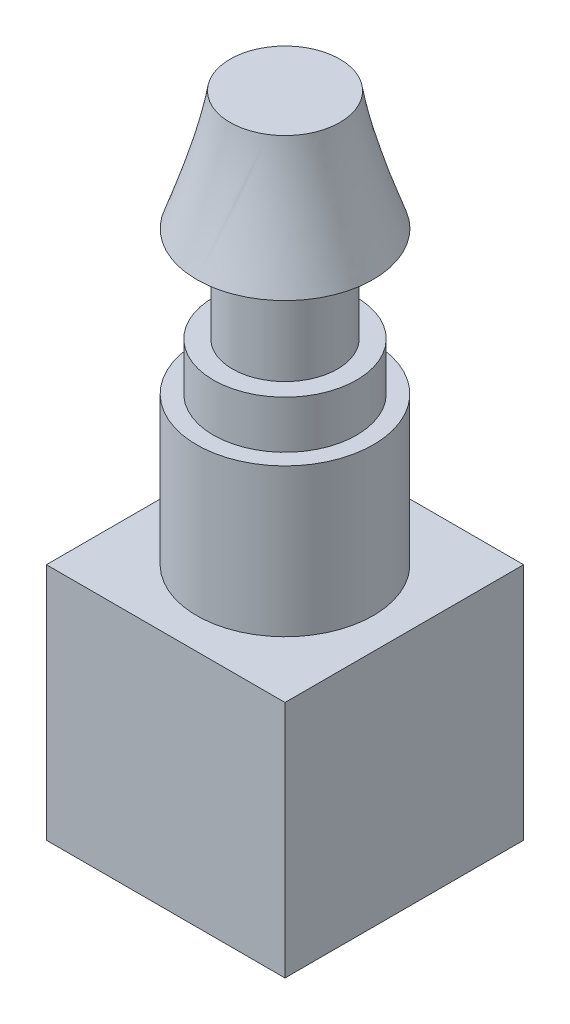
ISO-10303-21;
HEADER;
FILE_DESCRIPTION(('STEP AP214'),'2;1');
FILE_NAME('part.step','',(''),(''),'','','');
FILE_SCHEMA(('AUTOMOTIVE_DESIGN { 1 0 10303 214 1 1 1 1 }'));
ENDSEC;
DATA;
#1=APPLICATION_CONTEXT('core data for automotive mechanical design processes');
#2=APPLICATION_PROTOCOL_DEFINITION('international standard','automotive_design',2000,#1);
#3=PRODUCT_CONTEXT('',#1,'mechanical');
#4=PRODUCT('Part','Part','',(#3));
#5=PRODUCT_RELATED_PRODUCT_CATEGORY('part','',(#4));
#6=PRODUCT_DEFINITION_FORMATION('','',#4);
#7=PRODUCT_DEFINITION_CONTEXT('part definition',#1,'design');
#8=PRODUCT_DEFINITION('design','',#6,#7);
#9=PRODUCT_DEFINITION_SHAPE('','',#8);
#10=(LENGTH_UNIT() NAMED_UNIT(*) SI_UNIT(.MILLI.,.METRE.));
#11=(NAMED_UNIT(*) PLANE_ANGLE_UNIT() SI_UNIT($,.RADIAN.));
#12=(NAMED_UNIT(*) SI_UNIT($,.STERADIAN.) SOLID_ANGLE_UNIT());
#13=UNCERTAINTY_MEASURE_WITH_UNIT(LENGTH_MEASURE(1.E-05),#10,'distance_accuracy_value','');
#14=(GEOMETRIC_REPRESENTATION_CONTEXT(3) GLOBAL_UNCERTAINTY_ASSIGNED_CONTEXT((#13)) GLOBAL_UNIT_ASSIGNED_CONTEXT((#10,
#11,#12)) REPRESENTATION_CONTEXT('',''));
#15=CARTESIAN_POINT('',(0.,0.,0.));
#16=DIRECTION('',(0.,0.,1.));
#17=DIRECTION('',(1.,0.,0.));
#18=AXIS2_PLACEMENT_3D('',#15,#16,#17);
#19=CARTESIAN_POINT('',(0.,3.1,0.));
#20=DIRECTION('',(0.,-1.,0.));
#21=DIRECTION('',(0.,0.,-1.));
#22=AXIS2_PLACEMENT_3D('',#19,#20,#21);
#23=CYLINDRICAL_SURFACE('',#22,1.85);
#24=CARTESIAN_POINT('',(0.,3.1,0.));
#25=DIRECTION('',(0.,1.,0.));
#26=DIRECTION('',(0.,0.,1.));
#27=AXIS2_PLACEMENT_3D('',#24,#25,#26);
#28=CIRCLE('',#27,1.85);
#29=CARTESIAN_POINT('',(0.,3.1,-1.85));
#30=VERTEX_POINT('',#29);
#31=EDGE_CURVE('E174',#30,#30,#28,.T.);
#32=CARTESIAN_POINT('',(0.,0.,0.));
#33=DIRECTION('',(0.,1.,0.));
#34=DIRECTION('',(0.,0.,1.));
#35=AXIS2_PLACEMENT_3D('',#32,#33,#34);
#36=CIRCLE('',#35,1.85);
#37=CARTESIAN_POINT('',(0.,0.,-1.85));
#38=VERTEX_POINT('',#37);
#39=EDGE_CURVE('E42',#38,#38,#36,.T.);
#40=CARTESIAN_POINT('',(0.,3.1,-1.85));
#41=CARTESIAN_POINT('',(0.,3.06770833333333,-1.85));
#42=CARTESIAN_POINT('',(0.,3.03541666666667,-1.85));
#43=CARTESIAN_POINT('',(0.,2.97083333333333,-1.85));
#44=CARTESIAN_POINT('',(0.,2.93854166666667,-1.85));
#45=CARTESIAN_POINT('',(0.,2.87395833333333,-1.85));
#46=CARTESIAN_POINT('',(0.,2.84166666666667,-1.85));
#47=CARTESIAN_POINT('',(0.,2.77708333333333,-1.85));
#48=CARTESIAN_POINT('',(0.,2.74479166666667,-1.85));
#49=CARTESIAN_POINT('',(0.,2.68020833333333,-1.85));
#50=CARTESIAN_POINT('',(0.,2.64791666666667,-1.85));
#51=CARTESIAN_POINT('',(0.,2.58333333333333,-1.85));
#52=CARTESIAN_POINT('',(0.,2.55104166666667,-1.85));
#53=CARTESIAN_POINT('',(0.,2.48645833333333,-1.85));
#54=CARTESIAN_POINT('',(0.,2.45416666666667,-1.85));
#55=CARTESIAN_POINT('',(0.,2.38958333333333,-1.85));
#56=CARTESIAN_POINT('',(0.,2.35729166666667,-1.85));
#57=CARTESIAN_POINT('',(0.,2.29270833333333,-1.85));
#58=CARTESIAN_POINT('',(0.,2.26041666666667,-1.85));
#59=CARTESIAN_POINT('',(0.,2.19583333333333,-1.85));
#60=CARTESIAN_POINT('',(0.,2.16354166666667,-1.85));
#61=CARTESIAN_POINT('',(0.,2.09895833333333,-1.85));
#62=CARTESIAN_POINT('',(0.,2.06666666666667,-1.85));
#63=CARTESIAN_POINT('',(0.,2.00208333333333,-1.85));
#64=CARTESIAN_POINT('',(0.,1.96979166666667,-1.85));
#65=CARTESIAN_POINT('',(0.,1.90520833333333,-1.85));
#66=CARTESIAN_POINT('',(0.,1.87291666666667,-1.85));
#67=CARTESIAN_POINT('',(0.,1.80833333333333,-1.85));
#68=CARTESIAN_POINT('',(0.,1.77604166666667,-1.85));
#69=CARTESIAN_POINT('',(0.,1.71145833333333,-1.85));
#70=CARTESIAN_POINT('',(0.,1.67916666666667,-1.85));
#71=CARTESIAN_POINT('',(0.,1.61458333333333,-1.85));
#72=CARTESIAN_POINT('',(0.,1.58229166666667,-1.85));
#73=CARTESIAN_POINT('',(0.,1.51770833333333,-1.85));
#74=CARTESIAN_POINT('',(0.,1.48541666666667,-1.85));
#75=CARTESIAN_POINT('',(0.,1.42083333333333,-1.85));
#76=CARTESIAN_POINT('',(0.,1.38854166666667,-1.85));
#77=CARTESIAN_POINT('',(0.,1.32395833333333,-1.85));
#78=CARTESIAN_POINT('',(0.,1.29166666666667,-1.85));
#79=CARTESIAN_POINT('',(0.,1.22708333333333,-1.85));
#80=CARTESIAN_POINT('',(0.,1.19479166666667,-1.85));
#81=CARTESIAN_POINT('',(0.,1.13020833333333,-1.85));
#82=CARTESIAN_POINT('',(0.,1.09791666666667,-1.85));
#83=CARTESIAN_POINT('',(0.,1.03333333333333,-1.85));
#84=CARTESIAN_POINT('',(0.,1.00104166666667,-1.85));
#85=CARTESIAN_POINT('',(0.,0.936458333333333,-1.85));
#86=CARTESIAN_POINT('',(0.,0.904166666666667,-1.85));
#87=CARTESIAN_POINT('',(0.,0.839583333333333,-1.85));
#88=CARTESIAN_POINT('',(0.,0.807291666666667,-1.85));
#89=CARTESIAN_POINT('',(0.,0.742708333333333,-1.85));
#90=CARTESIAN_POINT('',(0.,0.710416666666667,-1.85));
#91=CARTESIAN_POINT('',(0.,0.645833333333333,-1.85));
#92=CARTESIAN_POINT('',(0.,0.613541666666667,-1.85));
#93=CARTESIAN_POINT('',(0.,0.548958333333333,-1.85));
#94=CARTESIAN_POINT('',(0.,0.516666666666667,-1.85));
#95=CARTESIAN_POINT('',(0.,0.452083333333333,-1.85));
#96=CARTESIAN_POINT('',(0.,0.419791666666667,-1.85));
#97=CARTESIAN_POINT('',(0.,0.355208333333333,-1.85));
#98=CARTESIAN_POINT('',(0.,0.322916666666667,-1.85));
#99=CARTESIAN_POINT('',(0.,0.258333333333333,-1.85));
#100=CARTESIAN_POINT('',(0.,0.226041666666667,-1.85));
#101=CARTESIAN_POINT('',(0.,0.161458333333333,-1.85));
#102=CARTESIAN_POINT('',(0.,0.129166666666667,-1.85));
#103=CARTESIAN_POINT('',(0.,0.0645833333333335,-1.85));
#104=CARTESIAN_POINT('',(0.,0.0322916666666667,-1.85));
#105=CARTESIAN_POINT('',(0.,0.,-1.85));
#106=B_SPLINE_CURVE_WITH_KNOTS('',3,(#40,#41,#42,#43,#44,#45,#46,#47,#48,#49,#50,#51,#52,#53,
#54,#55,#56,#57,#58,#59,#60,#61,#62,#63,#64,#65,#66,#67,#68,#69,#70,#71,#72,#73,#74,#75,#76,#77,
#78,#79,#80,#81,#82,#83,#84,#85,#86,#87,#88,#89,#90,#91,#92,#93,#94,#95,#96,#97,#98,#99,#100,
#101,#102,#103,#104,#105),.UNSPECIFIED.,.F.,.F.,(4,2,2,2,2,2,2,2,2,2,2,2,2,2,2,2,2,2,2,2,2,2,2,
2,2,2,2,2,2,2,2,2,4),(0.,0.0968749999999997,0.19375,0.290625,0.3875,0.484375,0.58125,0.678125,
0.775,0.871874999999999,0.96875,1.065625,1.1625,1.259375,1.35625,1.453125,1.55,1.646875,1.74375,
1.840625,1.9375,2.034375,2.13125,2.228125,2.325,2.421875,2.51875,2.615625,2.7125,2.809375,
2.90625,3.003125,3.1),.UNSPECIFIED.);
#107=EDGE_CURVE('BSEAM39',#30,#38,#106,.T.);
#108=ORIENTED_EDGE('',*,*,#31,.F.);
#109=ORIENTED_EDGE('',*,*,#39,.T.);
#110=ORIENTED_EDGE('',*,*,#107,.T.);
#111=ORIENTED_EDGE('',*,*,#107,.F.);
#112=EDGE_LOOP('',(#108,#110,#109,#111));
#113=FACE_BOUND('',#112,.T.);
#114=ADVANCED_FACE('F39',(#113),#23,.T.);
#115=CARTESIAN_POINT('',(0.,3.1,0.));
#116=DIRECTION('',(0.,1.,0.));
#117=DIRECTION('',(0.,0.,1.));
#118=AXIS2_PLACEMENT_3D('',#115,#116,#117);
#119=PLANE('',#118);
#120=CARTESIAN_POINT('',(0.,3.1,0.));
#121=DIRECTION('',(0.,1.,0.));
#122=DIRECTION('',(0.,0.,1.));
#123=AXIS2_PLACEMENT_3D('',#120,#121,#122);
#124=CIRCLE('',#123,1.5);
#125=CARTESIAN_POINT('',(0.,3.1,1.5));
#126=VERTEX_POINT('',#125);
#127=EDGE_CURVE('E48',#126,#126,#124,.T.);
#128=ORIENTED_EDGE('',*,*,#127,.F.);
#129=EDGE_LOOP('',(#128));
#130=FACE_BOUND('',#129,.T.);
#131=ORIENTED_EDGE('',*,*,#31,.T.);
#132=EDGE_LOOP('',(#131));
#133=FACE_BOUND('',#132,.T.);
#134=ADVANCED_FACE('F179',(#130,#133),#119,.T.);
#135=CARTESIAN_POINT('',(0.,4.1,0.));
#136=DIRECTION('',(0.,-1.,0.));
#137=DIRECTION('',(0.,0.,-1.));
#138=AXIS2_PLACEMENT_3D('',#135,#136,#137);
#139=CYLINDRICAL_SURFACE('',#138,1.5);
#140=CARTESIAN_POINT('',(0.,4.1,0.));
#141=DIRECTION('',(0.,1.,0.));
#142=DIRECTION('',(0.,0.,1.));
#143=AXIS2_PLACEMENT_3D('',#140,#141,#142);
#144=CIRCLE('',#143,1.5);
#145=CARTESIAN_POINT('',(0.,4.1,1.5));
#146=VERTEX_POINT('',#145);
#147=EDGE_CURVE('E170',#146,#146,#144,.T.);
#148=ORIENTED_EDGE('',*,*,#147,.F.);
#149=EDGE_LOOP('',(#148));
#150=FACE_BOUND('',#149,.T.);
#151=ORIENTED_EDGE('',*,*,#127,.T.);
#152=EDGE_LOOP('',(#151));
#153=FACE_BOUND('',#152,.T.);
#154=ADVANCED_FACE('F202',(#150,#153),#139,.T.);
#155=CARTESIAN_POINT('',(0.,4.1,0.));
#156=DIRECTION('',(0.,1.,0.));
#157=DIRECTION('',(0.,0.,1.));
#158=AXIS2_PLACEMENT_3D('',#155,#156,#157);
#159=PLANE('',#158);
#160=CARTESIAN_POINT('',(0.,4.1,0.));
#161=DIRECTION('',(0.,1.,0.));
#162=DIRECTION('',(0.,0.,1.));
#163=AXIS2_PLACEMENT_3D('',#160,#161,#162);
#164=CIRCLE('',#163,1.1);
#165=CARTESIAN_POINT('',(0.,4.1,1.1));
#166=VERTEX_POINT('',#165);
#167=EDGE_CURVE('E12',#166,#166,#164,.T.);
#168=ORIENTED_EDGE('',*,*,#167,.F.);
#169=EDGE_LOOP('',(#168));
#170=FACE_BOUND('',#169,.T.);
#171=ORIENTED_EDGE('',*,*,#147,.T.);
#172=EDGE_LOOP('',(#171));
#173=FACE_BOUND('',#172,.T.);
#174=ADVANCED_FACE('F197',(#170,#173),#159,.T.);
#175=CARTESIAN_POINT('',(0.,6.1,0.));
#176=DIRECTION('',(0.,-1.,0.));
#177=DIRECTION('',(0.,0.,-1.));
#178=AXIS2_PLACEMENT_3D('',#175,#176,#177);
#179=CYLINDRICAL_SURFACE('',#178,1.1);
#180=CARTESIAN_POINT('',(0.,6.1,0.));
#181=DIRECTION('',(0.,1.,0.));
#182=DIRECTION('',(0.,0.,1.));
#183=AXIS2_PLACEMENT_3D('',#180,#181,#182);
#184=CIRCLE('',#183,1.1);
#185=CARTESIAN_POINT('',(0.,6.1,1.1));
#186=VERTEX_POINT('',#185);
#187=EDGE_CURVE('E166',#186,#186,#184,.T.);
#188=ORIENTED_EDGE('',*,*,#187,.F.);
#189=EDGE_LOOP('',(#188));
#190=FACE_BOUND('',#189,.T.);
#191=ORIENTED_EDGE('',*,*,#167,.T.);
#192=EDGE_LOOP('',(#191));
#193=FACE_BOUND('',#192,.T.);
#194=ADVANCED_FACE('F153',(#190,#193),#179,.T.);
#195=CARTESIAN_POINT('',(0.,8.6,0.));
#196=DIRECTION('',(0.,1.,0.));
#197=DIRECTION('',(0.,0.,1.));
#198=AXIS2_PLACEMENT_3D('',#195,#196,#197);
#199=PLANE('',#198);
#200=CARTESIAN_POINT('',(0.,8.6,0.));
#201=DIRECTION('',(0.,1.,0.));
#202=DIRECTION('',(0.,0.,1.));
#203=AXIS2_PLACEMENT_3D('',#200,#201,#202);
#204=CIRCLE('',#203,1.15);
#205=CARTESIAN_POINT('',(0.620465420838555,8.6,0.968257538851949));
#206=VERTEX_POINT('',#205);
#207=EDGE_CURVE('E121',#206,#206,#204,.T.);
#208=ORIENTED_EDGE('',*,*,#207,.T.);
#209=EDGE_LOOP('',(#208));
#210=FACE_BOUND('',#209,.T.);
#211=ADVANCED_FACE('F144',(#210),#199,.T.);
#212=CARTESIAN_POINT('',(0.,6.1,0.));
#213=DIRECTION('',(0.,1.,0.));
#214=DIRECTION('',(0.,0.,1.));
#215=AXIS2_PLACEMENT_3D('',#212,#213,#214);
#216=PLANE('',#215);
#217=ORIENTED_EDGE('',*,*,#187,.T.);
#218=EDGE_LOOP('',(#217));
#219=FACE_BOUND('',#218,.T.);
#220=CARTESIAN_POINT('',(0.,6.1,0.));
#221=DIRECTION('',(0.,1.,0.));
#222=DIRECTION('',(0.,0.,1.));
#223=AXIS2_PLACEMENT_3D('',#220,#221,#222);
#224=CIRCLE('',#223,1.85);
#225=CARTESIAN_POINT('',(0.,6.1,1.85));
#226=VERTEX_POINT('',#225);
#227=EDGE_CURVE('E126',#226,#226,#224,.T.);
#228=ORIENTED_EDGE('',*,*,#227,.F.);
#229=EDGE_LOOP('',(#228));
#230=FACE_BOUND('',#229,.T.);
#231=ADVANCED_FACE('F141',(#219,#230),#216,.F.);
#232=CARTESIAN_POINT('',(0.,6.1,1.85));
#233=CARTESIAN_POINT('',(0.620465420838555,8.6,0.968257538851949));
#234=CARTESIAN_POINT('',(3.7,6.1,1.85));
#235=CARTESIAN_POINT('',(2.55698049854245,8.6,-0.272673302825161));
#236=CARTESIAN_POINT('',(3.7,6.1,-1.85));
#237=CARTESIAN_POINT('',(1.31604965686534,8.6,-2.20918838052906));
#238=CARTESIAN_POINT('',(0.,6.1,-1.85));
#239=CARTESIAN_POINT('',(-0.620465420838555,8.6,-0.96825753885195));
#240=CARTESIAN_POINT('',(-3.7,6.1,-1.85));
#241=CARTESIAN_POINT('',(-2.55698049854246,8.6,0.272673302825162));
#242=CARTESIAN_POINT('',(-3.7,6.1,1.85));
#243=CARTESIAN_POINT('',(-1.31604965686534,8.6,2.20918838052906));
#244=CARTESIAN_POINT('',(0.,6.1,1.85));
#245=CARTESIAN_POINT('',(0.620465420838555,8.6,0.968257538851949));
#246=(BOUNDED_SURFACE() B_SPLINE_SURFACE(3,1,((#232,#233),(#234,#235),(#236,#237),(#238,#239),
(#240,#241),(#242,#243),(#244,#245)),.UNSPECIFIED.,.T.,.F.,.F.) B_SPLINE_SURFACE_WITH_KNOTS((4,
3,4),(2,2),(0.,0.5,1.),(0.,1.),
.UNSPECIFIED.) GEOMETRIC_REPRESENTATION_ITEM() RATIONAL_B_SPLINE_SURFACE(((1.,1.),
(0.333333333333333,0.333333333333333),(0.333333333333333,0.333333333333333),(1.,1.),
(0.333333333333333,0.333333333333333),(0.333333333333333,0.333333333333333),(1.,1.))) REPRESENTATION_ITEM('') SURFACE());
#247=CARTESIAN_POINT('',(0.,6.1,1.85));
#248=CARTESIAN_POINT('',(0.00646318146706835,6.12604166666667,1.84081518269637));
#249=CARTESIAN_POINT('',(0.0129263629341366,6.15208333333333,1.83163036539275));
#250=CARTESIAN_POINT('',(0.0258527258682731,6.20416666666667,1.8132607307855));
#251=CARTESIAN_POINT('',(0.0323159073353414,6.23020833333333,1.80407591348187));
#252=CARTESIAN_POINT('',(0.045242270269478,6.28229166666667,1.78570627887462));
#253=CARTESIAN_POINT('',(0.0517054517365463,6.30833333333333,1.776521461571));
#254=CARTESIAN_POINT('',(0.0646318146706829,6.36041666666667,1.75815182696374));
#255=CARTESIAN_POINT('',(0.0710949961377511,6.38645833333333,1.74896700966012));
#256=CARTESIAN_POINT('',(0.0840213590718877,6.43854166666667,1.73059737505287));
#257=CARTESIAN_POINT('',(0.090484540538956,6.46458333333333,1.72141255774924));
#258=CARTESIAN_POINT('',(0.103410903473093,6.51666666666667,1.70304292314199));
#259=CARTESIAN_POINT('',(0.109874084940161,6.54270833333333,1.69385810583837));
#260=CARTESIAN_POINT('',(0.122800447874297,6.59479166666667,1.67548847123112));
#261=CARTESIAN_POINT('',(0.129263629341366,6.62083333333333,1.66630365392749));
#262=CARTESIAN_POINT('',(0.142189992275502,6.67291666666667,1.64793401932024));
#263=CARTESIAN_POINT('',(0.148653173742571,6.69895833333333,1.63874920201661));
#264=CARTESIAN_POINT('',(0.161579536676707,6.75104166666667,1.62037956740936));
#265=CARTESIAN_POINT('',(0.168042718143775,6.77708333333333,1.61119475010574));
#266=CARTESIAN_POINT('',(0.180969081077912,6.82916666666667,1.59282511549849));
#267=CARTESIAN_POINT('',(0.18743226254498,6.85520833333333,1.58364029819486));
#268=CARTESIAN_POINT('',(0.200358625479117,6.90729166666667,1.56527066358761));
#269=CARTESIAN_POINT('',(0.206821806946185,6.93333333333333,1.55608584628398));
#270=CARTESIAN_POINT('',(0.219748169880322,6.98541666666667,1.53771621167673));
#271=CARTESIAN_POINT('',(0.22621135134739,7.01145833333333,1.52853139437311));
#272=CARTESIAN_POINT('',(0.239137714281527,7.06354166666667,1.51016175976586));
#273=CARTESIAN_POINT('',(0.245600895748595,7.08958333333333,1.50097694246223));
#274=CARTESIAN_POINT('',(0.258527258682731,7.14166666666667,1.48260730785498));
#275=CARTESIAN_POINT('',(0.2649904401498,7.16770833333333,1.47342249055135));
#276=CARTESIAN_POINT('',(0.277916803083936,7.21979166666667,1.4550528559441));
#277=CARTESIAN_POINT('',(0.284379984551005,7.24583333333333,1.44586803864048));
#278=CARTESIAN_POINT('',(0.297306347485141,7.29791666666667,1.42749840403323));
#279=CARTESIAN_POINT('',(0.303769528952209,7.32395833333333,1.4183135867296));
#280=CARTESIAN_POINT('',(0.316695891886346,7.37604166666667,1.39994395212235));
#281=CARTESIAN_POINT('',(0.323159073353414,7.40208333333333,1.39075913481872));
#282=CARTESIAN_POINT('',(0.336085436287551,7.45416666666667,1.37238950021147));
#283=CARTESIAN_POINT('',(0.342548617754619,7.48020833333333,1.36320468290785));
#284=CARTESIAN_POINT('',(0.355474980688756,7.53229166666667,1.3448350483006));
#285=CARTESIAN_POINT('',(0.361938162155824,7.55833333333333,1.33565023099697));
#286=CARTESIAN_POINT('',(0.374864525089961,7.61041666666667,1.31728059638972));
#287=CARTESIAN_POINT('',(0.381327706557029,7.63645833333333,1.30809577908609));
#288=CARTESIAN_POINT('',(0.394254069491165,7.68854166666667,1.28972614447884));
#289=CARTESIAN_POINT('',(0.400717250958234,7.71458333333333,1.28054132717522));
#290=CARTESIAN_POINT('',(0.41364361389237,7.76666666666667,1.26217169256797));
#291=CARTESIAN_POINT('',(0.420106795359439,7.79270833333333,1.25298687526434));
#292=CARTESIAN_POINT('',(0.433033158293575,7.84479166666667,1.23461724065709));
#293=CARTESIAN_POINT('',(0.439496339760643,7.87083333333333,1.22543242335346));
#294=CARTESIAN_POINT('',(0.45242270269478,7.92291666666667,1.20706278874621));
#295=CARTESIAN_POINT('',(0.458885884161848,7.94895833333333,1.19787797144259));
#296=CARTESIAN_POINT('',(0.471812247095985,8.00104166666667,1.17950833683534));
#297=CARTESIAN_POINT('',(0.478275428563053,8.02708333333333,1.17032351953171));
#298=CARTESIAN_POINT('',(0.49120179149719,8.07916666666667,1.15195388492446));
#299=CARTESIAN_POINT('',(0.497664972964258,8.10520833333333,1.14276906762083));
#300=CARTESIAN_POINT('',(0.510591335898395,8.15729166666667,1.12439943301358));
#301=CARTESIAN_POINT('',(0.517054517365463,8.18333333333333,1.11521461570996));
#302=CARTESIAN_POINT('',(0.529980880299599,8.23541666666667,1.09684498110271));
#303=CARTESIAN_POINT('',(0.536444061766668,8.26145833333333,1.08766016379908));
#304=CARTESIAN_POINT('',(0.549370424700804,8.31354166666667,1.06929052919183));
#305=CARTESIAN_POINT('',(0.555833606167872,8.33958333333333,1.0601057118882));
#306=CARTESIAN_POINT('',(0.568759969102009,8.39166666666667,1.04173607728095));
#307=CARTESIAN_POINT('',(0.575223150569077,8.41770833333333,1.03255125997733));
#308=CARTESIAN_POINT('',(0.588149513503214,8.46979166666667,1.01418162537008));
#309=CARTESIAN_POINT('',(0.594612694970282,8.49583333333333,1.00499680806645));
#310=CARTESIAN_POINT('',(0.607539057904419,8.54791666666667,0.9866271734592));
#311=CARTESIAN_POINT('',(0.614002239371487,8.57395833333333,0.977442356155575));
#312=CARTESIAN_POINT('',(0.620465420838555,8.6,0.968257538851949));
#313=B_SPLINE_CURVE_WITH_KNOTS('',3,(#247,#248,#249,#250,#251,#252,#253,#254,#255,#256,#257,
#258,#259,#260,#261,#262,#263,#264,#265,#266,#267,#268,#269,#270,#271,#272,#273,#274,#275,#276,
#277,#278,#279,#280,#281,#282,#283,#284,#285,#286,#287,#288,#289,#290,#291,#292,#293,#294,#295,
#296,#297,#298,#299,#300,#301,#302,#303,#304,#305,#306,#307,#308,#309,#310,#311,#312),
.UNSPECIFIED.,.F.,.F.,(4,2,2,2,2,2,2,2,2,2,2,2,2,2,2,2,2,2,2,2,2,2,2,2,2,2,2,2,2,2,2,2,4),(0.,
0.0850806551290898,0.17016131025818,0.255241965387269,0.340322620516359,0.425403275645449,
0.510483930774539,0.595564585903629,0.680645241032718,0.765725896161807,0.850806551290897,
0.935887206419988,1.02096786154908,1.10604851667817,1.19112917180726,1.27620982693635,
1.36129048206544,1.44637113719453,1.53145179232361,1.6165324474527,1.70161310258179,
1.78669375771088,1.87177441283997,1.95685506796906,2.04193572309815,2.12701637822724,
2.21209703335633,2.29717768848542,2.38225834361451,2.4673389987436,2.55241965387269,
2.63750030900178,2.72258096413087),.UNSPECIFIED.);
#314=EDGE_CURVE('BSEAM128',#226,#206,#313,.T.);
#315=ORIENTED_EDGE('',*,*,#227,.T.);
#316=ORIENTED_EDGE('',*,*,#207,.F.);
#317=ORIENTED_EDGE('',*,*,#314,.T.);
#318=ORIENTED_EDGE('',*,*,#314,.F.);
#319=EDGE_LOOP('',(#315,#317,#316,#318));
#320=FACE_BOUND('',#319,.T.);
#321=ADVANCED_FACE('F128',(#320),#246,.T.);
#322=CARTESIAN_POINT('',(2.5,-5.,2.5));
#323=DIRECTION('',(-1.,0.,0.));
#324=DIRECTION('',(0.,0.,1.));
#325=AXIS2_PLACEMENT_3D('',#322,#323,#324);
#326=PLANE('',#325);
#327=DIRECTION('',(0.,0.,1.));
#328=VECTOR('',#327,1.);
#329=CARTESIAN_POINT('',(2.5,0.,2.5));
#330=LINE('',#329,#328);
#331=CARTESIAN_POINT('',(2.5,0.,-2.5));
#332=VERTEX_POINT('',#331);
#333=CARTESIAN_POINT('',(2.5,0.,2.5));
#334=VERTEX_POINT('',#333);
#335=EDGE_CURVE('E108',#332,#334,#330,.T.);
#336=ORIENTED_EDGE('',*,*,#335,.T.);
#337=DIRECTION('',(0.,1.,0.));
#338=VECTOR('',#337,1.);
#339=CARTESIAN_POINT('',(2.5,-5.,2.5));
#340=LINE('',#339,#338);
#341=CARTESIAN_POINT('',(2.5,-5.,2.5));
#342=VERTEX_POINT('',#341);
#343=EDGE_CURVE('E99',#342,#334,#340,.T.);
#344=ORIENTED_EDGE('',*,*,#343,.F.);
#345=DIRECTION('',(0.,0.,1.));
#346=VECTOR('',#345,1.);
#347=CARTESIAN_POINT('',(2.5,-5.,2.5));
#348=LINE('',#347,#346);
#349=CARTESIAN_POINT('',(2.5,-5.,-2.5));
#350=VERTEX_POINT('',#349);
#351=EDGE_CURVE('E93',#350,#342,#348,.T.);
#352=ORIENTED_EDGE('',*,*,#351,.F.);
#353=DIRECTION('',(0.,1.,0.));
#354=VECTOR('',#353,1.);
#355=CARTESIAN_POINT('',(2.5,-5.,-2.5));
#356=LINE('',#355,#354);
#357=EDGE_CURVE('E104',#350,#332,#356,.T.);
#358=ORIENTED_EDGE('',*,*,#357,.T.);
#359=EDGE_LOOP('',(#336,#344,#352,#358));
#360=FACE_BOUND('',#359,.T.);
#361=ADVANCED_FACE('F140',(#360),#326,.F.);
#362=CARTESIAN_POINT('',(-2.5,-5.,2.5));
#363=DIRECTION('',(0.,0.,-1.));
#364=DIRECTION('',(-1.,0.,0.));
#365=AXIS2_PLACEMENT_3D('',#362,#363,#364);
#366=PLANE('',#365);
#367=DIRECTION('',(-1.,0.,0.));
#368=VECTOR('',#367,1.);
#369=CARTESIAN_POINT('',(-2.5,0.,2.5));
#370=LINE('',#369,#368);
#371=CARTESIAN_POINT('',(-2.5,0.,2.5));
#372=VERTEX_POINT('',#371);
#373=EDGE_CURVE('E98',#334,#372,#370,.T.);
#374=ORIENTED_EDGE('',*,*,#373,.T.);
#375=DIRECTION('',(0.,1.,0.));
#376=VECTOR('',#375,1.);
#377=CARTESIAN_POINT('',(-2.5,-5.,2.5));
#378=LINE('',#377,#376);
#379=CARTESIAN_POINT('',(-2.5,-5.,2.5));
#380=VERTEX_POINT('',#379);
#381=EDGE_CURVE('E96',#380,#372,#378,.T.);
#382=ORIENTED_EDGE('',*,*,#381,.F.);
#383=DIRECTION('',(-1.,0.,0.));
#384=VECTOR('',#383,1.);
#385=CARTESIAN_POINT('',(-2.5,-5.,2.5));
#386=LINE('',#385,#384);
#387=EDGE_CURVE('E88',#342,#380,#386,.T.);
#388=ORIENTED_EDGE('',*,*,#387,.F.);
#389=ORIENTED_EDGE('',*,*,#343,.T.);
#390=EDGE_LOOP('',(#374,#382,#388,#389));
#391=FACE_BOUND('',#390,.T.);
#392=ADVANCED_FACE('F97',(#391),#366,.F.);
#393=CARTESIAN_POINT('',(-2.5,-5.,2.5));
#394=DIRECTION('',(1.,0.,0.));
#395=DIRECTION('',(0.,0.,-1.));
#396=AXIS2_PLACEMENT_3D('',#393,#394,#395);
#397=PLANE('',#396);
#398=DIRECTION('',(0.,0.,-1.));
#399=VECTOR('',#398,1.);
#400=CARTESIAN_POINT('',(-2.5,0.,2.5));
#401=LINE('',#400,#399);
#402=CARTESIAN_POINT('',(-2.5,0.,-2.5));
#403=VERTEX_POINT('',#402);
#404=EDGE_CURVE('E74',#372,#403,#401,.T.);
#405=ORIENTED_EDGE('',*,*,#404,.T.);
#406=DIRECTION('',(0.,1.,0.));
#407=VECTOR('',#406,1.);
#408=CARTESIAN_POINT('',(-2.5,-5.,-2.5));
#409=LINE('',#408,#407);
#410=CARTESIAN_POINT('',(-2.5,-5.,-2.5));
#411=VERTEX_POINT('',#410);
#412=EDGE_CURVE('E100',#411,#403,#409,.T.);
#413=ORIENTED_EDGE('',*,*,#412,.F.);
#414=DIRECTION('',(0.,0.,-1.));
#415=VECTOR('',#414,1.);
#416=CARTESIAN_POINT('',(-2.5,-5.,2.5));
#417=LINE('',#416,#415);
#418=EDGE_CURVE('E91',#380,#411,#417,.T.);
#419=ORIENTED_EDGE('',*,*,#418,.F.);
#420=ORIENTED_EDGE('',*,*,#381,.T.);
#421=EDGE_LOOP('',(#405,#413,#419,#420));
#422=FACE_BOUND('',#421,.T.);
#423=ADVANCED_FACE('F102',(#422),#397,.F.);
#424=CARTESIAN_POINT('',(-2.5,-5.,-2.5));
#425=DIRECTION('',(0.,0.,1.));
#426=DIRECTION('',(1.,0.,0.));
#427=AXIS2_PLACEMENT_3D('',#424,#425,#426);
#428=PLANE('',#427);
#429=DIRECTION('',(1.,0.,0.));
#430=VECTOR('',#429,1.);
#431=CARTESIAN_POINT('',(-2.5,0.,-2.5));
#432=LINE('',#431,#430);
#433=EDGE_CURVE('E80',#403,#332,#432,.T.);
#434=ORIENTED_EDGE('',*,*,#433,.T.);
#435=ORIENTED_EDGE('',*,*,#357,.F.);
#436=DIRECTION('',(1.,0.,0.));
#437=VECTOR('',#436,1.);
#438=CARTESIAN_POINT('',(-2.5,-5.,-2.5));
#439=LINE('',#438,#437);
#440=EDGE_CURVE('E57',#411,#350,#439,.T.);
#441=ORIENTED_EDGE('',*,*,#440,.F.);
#442=ORIENTED_EDGE('',*,*,#412,.T.);
#443=EDGE_LOOP('',(#434,#435,#441,#442));
#444=FACE_BOUND('',#443,.T.);
#445=ADVANCED_FACE('F266',(#444),#428,.F.);
#446=CARTESIAN_POINT('',(0.,-5.,0.));
#447=DIRECTION('',(0.,-1.,0.));
#448=DIRECTION('',(0.,0.,-1.));
#449=AXIS2_PLACEMENT_3D('',#446,#447,#448);
#450=PLANE('',#449);
#451=ORIENTED_EDGE('',*,*,#351,.T.);
#452=ORIENTED_EDGE('',*,*,#387,.T.);
#453=ORIENTED_EDGE('',*,*,#418,.T.);
#454=ORIENTED_EDGE('',*,*,#440,.T.);
#455=EDGE_LOOP('',(#451,#452,#453,#454));
#456=FACE_BOUND('',#455,.T.);
#457=ADVANCED_FACE('F89',(#456),#450,.T.);
#458=CARTESIAN_POINT('',(0.,0.,0.));
#459=DIRECTION('',(0.,-1.,0.));
#460=DIRECTION('',(0.,0.,-1.));
#461=AXIS2_PLACEMENT_3D('',#458,#459,#460);
#462=PLANE('',#461);
#463=ORIENTED_EDGE('',*,*,#39,.F.);
#464=EDGE_LOOP('',(#463));
#465=FACE_BOUND('',#464,.T.);
#466=ORIENTED_EDGE('',*,*,#335,.F.);
#467=ORIENTED_EDGE('',*,*,#433,.F.);
#468=ORIENTED_EDGE('',*,*,#404,.F.);
#469=ORIENTED_EDGE('',*,*,#373,.F.);
#470=EDGE_LOOP('',(#466,#467,#468,#469));
#471=FACE_BOUND('',#470,.T.);
#472=ADVANCED_FACE('F283',(#465,#471),#462,.F.);
#473=CLOSED_SHELL('',(#114,#134,#154,#174,#194,#211,#231,#321,#361,#392,#423,#445,#457,#472));
#474=MANIFOLD_SOLID_BREP('B2',#473);
#475=ADVANCED_BREP_SHAPE_REPRESENTATION('',(#18,#474),#14);
#476=SHAPE_DEFINITION_REPRESENTATION(#9,#475);
ENDSEC;
END-ISO-10303-21;
